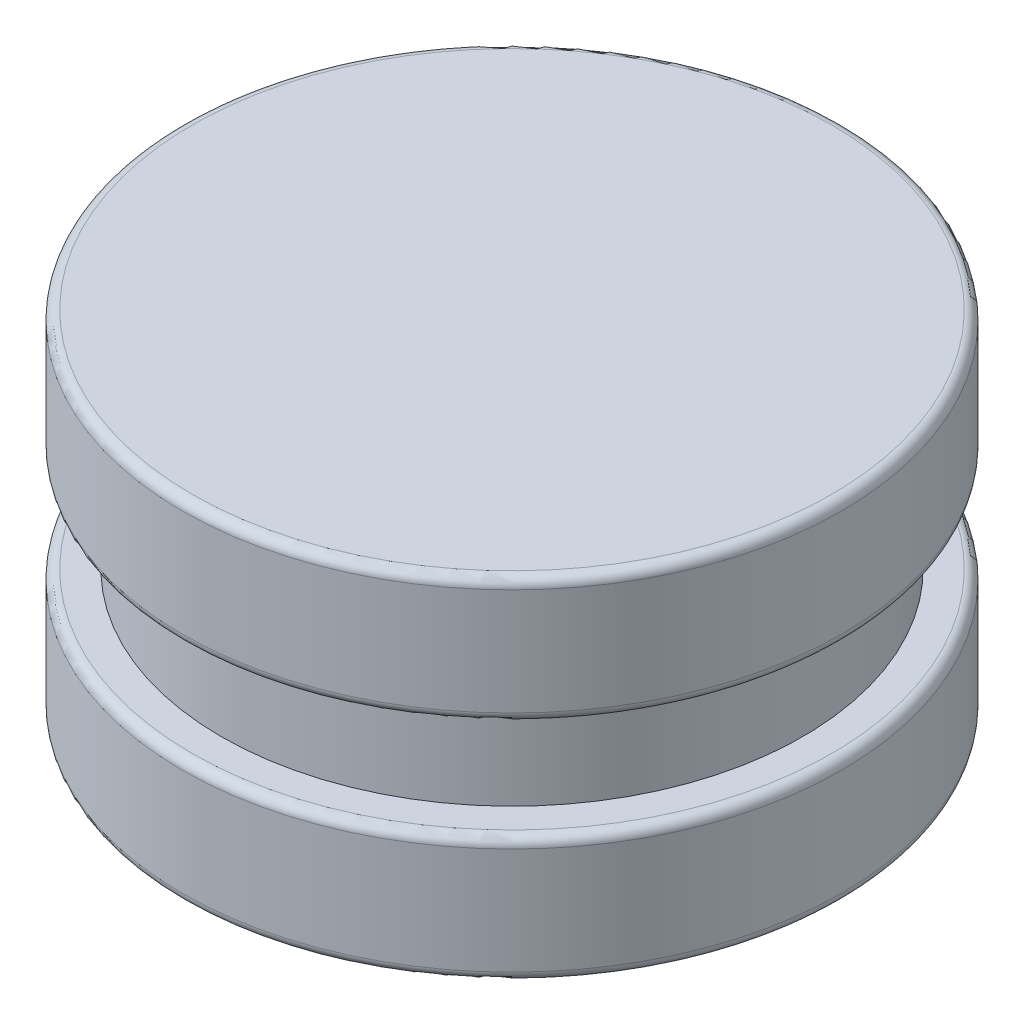
ISO-10303-21;
HEADER;
FILE_DESCRIPTION(('STEP AP214'),'2;1');
FILE_NAME('part.step','',(''),(''),'','','');
FILE_SCHEMA(('AUTOMOTIVE_DESIGN { 1 0 10303 214 1 1 1 1 }'));
ENDSEC;
DATA;
#1=APPLICATION_CONTEXT('core data for automotive mechanical design processes');
#2=APPLICATION_PROTOCOL_DEFINITION('international standard','automotive_design',2000,#1);
#3=PRODUCT_CONTEXT('',#1,'mechanical');
#4=PRODUCT('Part','Part','',(#3));
#5=PRODUCT_RELATED_PRODUCT_CATEGORY('part','',(#4));
#6=PRODUCT_DEFINITION_FORMATION('','',#4);
#7=PRODUCT_DEFINITION_CONTEXT('part definition',#1,'design');
#8=PRODUCT_DEFINITION('design','',#6,#7);
#9=PRODUCT_DEFINITION_SHAPE('','',#8);
#10=(LENGTH_UNIT() NAMED_UNIT(*) SI_UNIT(.MILLI.,.METRE.));
#11=(NAMED_UNIT(*) PLANE_ANGLE_UNIT() SI_UNIT($,.RADIAN.));
#12=(NAMED_UNIT(*) SI_UNIT($,.STERADIAN.) SOLID_ANGLE_UNIT());
#13=UNCERTAINTY_MEASURE_WITH_UNIT(LENGTH_MEASURE(1.E-05),#10,'distance_accuracy_value','');
#14=(GEOMETRIC_REPRESENTATION_CONTEXT(3) GLOBAL_UNCERTAINTY_ASSIGNED_CONTEXT((#13)) GLOBAL_UNIT_ASSIGNED_CONTEXT((#10,
#11,#12)) REPRESENTATION_CONTEXT('',''));
#15=CARTESIAN_POINT('',(0.,0.,0.));
#16=DIRECTION('',(0.,0.,1.));
#17=DIRECTION('',(1.,0.,0.));
#18=AXIS2_PLACEMENT_3D('',#15,#16,#17);
#19=CARTESIAN_POINT('',(0.,13.,0.));
#20=DIRECTION('',(0.,-1.,0.));
#21=DIRECTION('',(0.,0.,-1.));
#22=AXIS2_PLACEMENT_3D('',#19,#20,#21);
#23=CYLINDRICAL_SURFACE('',#22,34.00044);
#24=CARTESIAN_POINT('',(0.,12.,0.));
#25=DIRECTION('',(0.,1.,0.));
#26=DIRECTION('',(0.,0.,1.));
#27=AXIS2_PLACEMENT_3D('',#24,#25,#26);
#28=CIRCLE('',#27,34.00044);
#29=CARTESIAN_POINT('',(0.,12.,34.00044));
#30=VERTEX_POINT('',#29);
#31=EDGE_CURVE('E43',#30,#30,#28,.F.);
#32=ORIENTED_EDGE('',*,*,#31,.T.);
#33=EDGE_LOOP('',(#32));
#34=FACE_BOUND('',#33,.T.);
#35=CARTESIAN_POINT('',(0.,0.999999999999999,0.));
#36=DIRECTION('',(0.,1.,0.));
#37=DIRECTION('',(0.,0.,1.));
#38=AXIS2_PLACEMENT_3D('',#35,#36,#37);
#39=CIRCLE('',#38,34.00044);
#40=CARTESIAN_POINT('',(0.,0.999999999999999,34.00044));
#41=VERTEX_POINT('',#40);
#42=EDGE_CURVE('E47',#41,#41,#39,.T.);
#43=ORIENTED_EDGE('',*,*,#42,.T.);
#44=EDGE_LOOP('',(#43));
#45=FACE_BOUND('',#44,.T.);
#46=ADVANCED_FACE('F36',(#34,#45),#23,.T.);
#47=CARTESIAN_POINT('',(0.,13.,0.));
#48=DIRECTION('',(0.,1.,0.));
#49=DIRECTION('',(0.,0.,1.));
#50=AXIS2_PLACEMENT_3D('',#47,#48,#49);
#51=PLANE('',#50);
#52=CARTESIAN_POINT('',(0.,13.,0.));
#53=DIRECTION('',(0.,1.,0.));
#54=DIRECTION('',(0.,0.,1.));
#55=AXIS2_PLACEMENT_3D('',#52,#53,#54);
#56=CIRCLE('',#55,30.);
#57=CARTESIAN_POINT('',(0.,13.,30.));
#58=VERTEX_POINT('',#57);
#59=EDGE_CURVE('E59',#58,#58,#56,.T.);
#60=ORIENTED_EDGE('',*,*,#59,.F.);
#61=EDGE_LOOP('',(#60));
#62=FACE_BOUND('',#61,.T.);
#63=CARTESIAN_POINT('',(0.,13.,0.));
#64=DIRECTION('',(0.,1.,0.));
#65=DIRECTION('',(0.,0.,1.));
#66=AXIS2_PLACEMENT_3D('',#63,#64,#65);
#67=CIRCLE('',#66,33.00044);
#68=CARTESIAN_POINT('',(0.,13.,33.00044));
#69=VERTEX_POINT('',#68);
#70=EDGE_CURVE('E51',#69,#69,#67,.T.);
#71=ORIENTED_EDGE('',*,*,#70,.T.);
#72=EDGE_LOOP('',(#71));
#73=FACE_BOUND('',#72,.T.);
#74=ADVANCED_FACE('F94',(#62,#73),#51,.T.);
#75=CARTESIAN_POINT('',(0.,0.,0.));
#76=DIRECTION('',(0.,1.,0.));
#77=DIRECTION('',(0.,0.,1.));
#78=AXIS2_PLACEMENT_3D('',#75,#76,#77);
#79=PLANE('',#78);
#80=CARTESIAN_POINT('',(0.,0.,0.));
#81=DIRECTION('',(0.,1.,0.));
#82=DIRECTION('',(0.,0.,1.));
#83=AXIS2_PLACEMENT_3D('',#80,#81,#82);
#84=CIRCLE('',#83,33.00044);
#85=CARTESIAN_POINT('',(0.,0.,33.00044));
#86=VERTEX_POINT('',#85);
#87=EDGE_CURVE('E10',#86,#86,#84,.F.);
#88=ORIENTED_EDGE('',*,*,#87,.T.);
#89=EDGE_LOOP('',(#88));
#90=FACE_BOUND('',#89,.T.);
#91=ADVANCED_FACE('F99',(#90),#79,.F.);
#92=CARTESIAN_POINT('',(0.,12.,0.));
#93=DIRECTION('',(0.,1.,0.));
#94=DIRECTION('',(0.,0.,1.));
#95=AXIS2_PLACEMENT_3D('',#92,#93,#94);
#96=TOROIDAL_SURFACE('',#95,33.00044,1.);
#97=ORIENTED_EDGE('',*,*,#31,.F.);
#98=EDGE_LOOP('',(#97));
#99=FACE_BOUND('',#98,.T.);
#100=ORIENTED_EDGE('',*,*,#70,.F.);
#101=EDGE_LOOP('',(#100));
#102=FACE_BOUND('',#101,.T.);
#103=ADVANCED_FACE('F104',(#99,#102),#96,.T.);
#104=CARTESIAN_POINT('',(0.,0.999999999999999,0.));
#105=DIRECTION('',(0.,1.,0.));
#106=DIRECTION('',(0.,0.,1.));
#107=AXIS2_PLACEMENT_3D('',#104,#105,#106);
#108=TOROIDAL_SURFACE('',#107,33.00044,1.);
#109=ORIENTED_EDGE('',*,*,#87,.F.);
#110=EDGE_LOOP('',(#109));
#111=FACE_BOUND('',#110,.T.);
#112=ORIENTED_EDGE('',*,*,#42,.F.);
#113=EDGE_LOOP('',(#112));
#114=FACE_BOUND('',#113,.T.);
#115=ADVANCED_FACE('F38',(#111,#114),#108,.T.);
#116=CARTESIAN_POINT('',(0.,36.162,0.));
#117=DIRECTION('',(0.,-1.,0.));
#118=DIRECTION('',(0.,0.,-1.));
#119=AXIS2_PLACEMENT_3D('',#116,#117,#118);
#120=CYLINDRICAL_SURFACE('',#119,30.);
#121=ORIENTED_EDGE('',*,*,#59,.T.);
#122=EDGE_LOOP('',(#121));
#123=FACE_BOUND('',#122,.T.);
#124=CARTESIAN_POINT('',(0.,23.16,0.));
#125=DIRECTION('',(0.,1.,0.));
#126=DIRECTION('',(0.,0.,1.));
#127=AXIS2_PLACEMENT_3D('',#124,#125,#126);
#128=CIRCLE('',#127,30.);
#129=CARTESIAN_POINT('',(0.,23.16,30.));
#130=VERTEX_POINT('',#129);
#131=EDGE_CURVE('E56',#130,#130,#128,.T.);
#132=ORIENTED_EDGE('',*,*,#131,.F.);
#133=EDGE_LOOP('',(#132));
#134=FACE_BOUND('',#133,.T.);
#135=ADVANCED_FACE('F111',(#123,#134),#120,.T.);
#136=CARTESIAN_POINT('',(0.,36.16,0.));
#137=DIRECTION('',(0.,-1.,0.));
#138=DIRECTION('',(0.,0.,-1.));
#139=AXIS2_PLACEMENT_3D('',#136,#137,#138);
#140=CYLINDRICAL_SURFACE('',#139,34.00044);
#141=CARTESIAN_POINT('',(0.,35.16,0.));
#142=DIRECTION('',(0.,1.,0.));
#143=DIRECTION('',(0.,0.,1.));
#144=AXIS2_PLACEMENT_3D('',#141,#142,#143);
#145=CIRCLE('',#144,34.00044);
#146=CARTESIAN_POINT('',(0.,35.16,34.00044));
#147=VERTEX_POINT('',#146);
#148=EDGE_CURVE('E65',#147,#147,#145,.F.);
#149=ORIENTED_EDGE('',*,*,#148,.T.);
#150=EDGE_LOOP('',(#149));
#151=FACE_BOUND('',#150,.T.);
#152=CARTESIAN_POINT('',(0.,24.16,0.));
#153=DIRECTION('',(0.,1.,0.));
#154=DIRECTION('',(0.,0.,1.));
#155=AXIS2_PLACEMENT_3D('',#152,#153,#154);
#156=CIRCLE('',#155,34.00044);
#157=CARTESIAN_POINT('',(0.,24.16,34.00044));
#158=VERTEX_POINT('',#157);
#159=EDGE_CURVE('E68',#158,#158,#156,.T.);
#160=ORIENTED_EDGE('',*,*,#159,.T.);
#161=EDGE_LOOP('',(#160));
#162=FACE_BOUND('',#161,.T.);
#163=ADVANCED_FACE('F135',(#151,#162),#140,.T.);
#164=CARTESIAN_POINT('',(0.,36.16,0.));
#165=DIRECTION('',(0.,1.,0.));
#166=DIRECTION('',(0.,0.,1.));
#167=AXIS2_PLACEMENT_3D('',#164,#165,#166);
#168=PLANE('',#167);
#169=CARTESIAN_POINT('',(0.,36.16,0.));
#170=DIRECTION('',(0.,1.,0.));
#171=DIRECTION('',(0.,0.,1.));
#172=AXIS2_PLACEMENT_3D('',#169,#170,#171);
#173=CIRCLE('',#172,33.00044);
#174=CARTESIAN_POINT('',(0.,36.16,33.00044));
#175=VERTEX_POINT('',#174);
#176=EDGE_CURVE('E71',#175,#175,#173,.T.);
#177=ORIENTED_EDGE('',*,*,#176,.T.);
#178=EDGE_LOOP('',(#177));
#179=FACE_BOUND('',#178,.T.);
#180=ADVANCED_FACE('F75',(#179),#168,.T.);
#181=CARTESIAN_POINT('',(0.,23.16,0.));
#182=DIRECTION('',(0.,1.,0.));
#183=DIRECTION('',(0.,0.,1.));
#184=AXIS2_PLACEMENT_3D('',#181,#182,#183);
#185=PLANE('',#184);
#186=ORIENTED_EDGE('',*,*,#131,.T.);
#187=EDGE_LOOP('',(#186));
#188=FACE_BOUND('',#187,.T.);
#189=CARTESIAN_POINT('',(0.,23.16,0.));
#190=DIRECTION('',(0.,1.,0.));
#191=DIRECTION('',(0.,0.,1.));
#192=AXIS2_PLACEMENT_3D('',#189,#190,#191);
#193=CIRCLE('',#192,33.00044);
#194=CARTESIAN_POINT('',(0.,23.16,33.00044));
#195=VERTEX_POINT('',#194);
#196=EDGE_CURVE('E62',#195,#195,#193,.F.);
#197=ORIENTED_EDGE('',*,*,#196,.T.);
#198=EDGE_LOOP('',(#197));
#199=FACE_BOUND('',#198,.T.);
#200=ADVANCED_FACE('F80',(#188,#199),#185,.F.);
#201=CARTESIAN_POINT('',(0.,35.16,0.));
#202=DIRECTION('',(0.,1.,0.));
#203=DIRECTION('',(0.,0.,1.));
#204=AXIS2_PLACEMENT_3D('',#201,#202,#203);
#205=TOROIDAL_SURFACE('',#204,33.00044,1.);
#206=ORIENTED_EDGE('',*,*,#148,.F.);
#207=EDGE_LOOP('',(#206));
#208=FACE_BOUND('',#207,.T.);
#209=ORIENTED_EDGE('',*,*,#176,.F.);
#210=EDGE_LOOP('',(#209));
#211=FACE_BOUND('',#210,.T.);
#212=ADVANCED_FACE('F77',(#208,#211),#205,.T.);
#213=CARTESIAN_POINT('',(0.,24.16,0.));
#214=DIRECTION('',(0.,1.,0.));
#215=DIRECTION('',(0.,0.,1.));
#216=AXIS2_PLACEMENT_3D('',#213,#214,#215);
#217=TOROIDAL_SURFACE('',#216,33.00044,1.);
#218=ORIENTED_EDGE('',*,*,#196,.F.);
#219=EDGE_LOOP('',(#218));
#220=FACE_BOUND('',#219,.T.);
#221=ORIENTED_EDGE('',*,*,#159,.F.);
#222=EDGE_LOOP('',(#221));
#223=FACE_BOUND('',#222,.T.);
#224=ADVANCED_FACE('F79',(#220,#223),#217,.T.);
#225=CLOSED_SHELL('',(#46,#74,#91,#103,#115,#135,#163,#180,#200,#212,#224));
#226=MANIFOLD_SOLID_BREP('B2',#225);
#227=ADVANCED_BREP_SHAPE_REPRESENTATION('',(#18,#226),#14);
#228=SHAPE_DEFINITION_REPRESENTATION(#9,#227);
ENDSEC;
END-ISO-10303-21;
